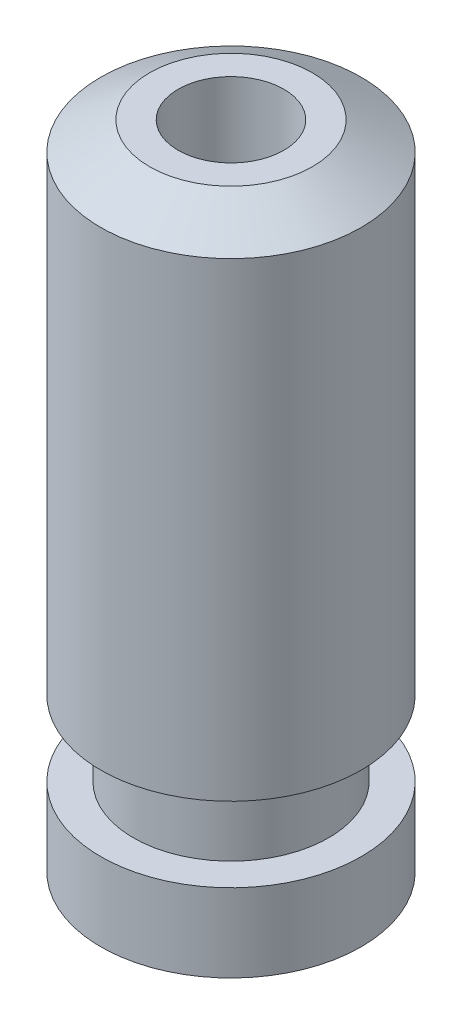
ISO-10303-21;
HEADER;
FILE_DESCRIPTION(('STEP AP214'),'2;1');
FILE_NAME('part.step','',(''),(''),'','','');
FILE_SCHEMA(('AUTOMOTIVE_DESIGN { 1 0 10303 214 1 1 1 1 }'));
ENDSEC;
DATA;
#1=APPLICATION_CONTEXT('core data for automotive mechanical design processes');
#2=APPLICATION_PROTOCOL_DEFINITION('international standard','automotive_design',2000,#1);
#3=PRODUCT_CONTEXT('',#1,'mechanical');
#4=PRODUCT('Part','Part','',(#3));
#5=PRODUCT_RELATED_PRODUCT_CATEGORY('part','',(#4));
#6=PRODUCT_DEFINITION_FORMATION('','',#4);
#7=PRODUCT_DEFINITION_CONTEXT('part definition',#1,'design');
#8=PRODUCT_DEFINITION('design','',#6,#7);
#9=PRODUCT_DEFINITION_SHAPE('','',#8);
#10=(LENGTH_UNIT() NAMED_UNIT(*) SI_UNIT(.MILLI.,.METRE.));
#11=(NAMED_UNIT(*) PLANE_ANGLE_UNIT() SI_UNIT($,.RADIAN.));
#12=(NAMED_UNIT(*) SI_UNIT($,.STERADIAN.) SOLID_ANGLE_UNIT());
#13=UNCERTAINTY_MEASURE_WITH_UNIT(LENGTH_MEASURE(1.E-05),#10,'distance_accuracy_value','');
#14=(GEOMETRIC_REPRESENTATION_CONTEXT(3) GLOBAL_UNCERTAINTY_ASSIGNED_CONTEXT((#13)) GLOBAL_UNIT_ASSIGNED_CONTEXT((#10,
#11,#12)) REPRESENTATION_CONTEXT('',''));
#15=CARTESIAN_POINT('',(0.,0.,0.));
#16=DIRECTION('',(0.,0.,1.));
#17=DIRECTION('',(1.,0.,0.));
#18=AXIS2_PLACEMENT_3D('',#15,#16,#17);
#19=CARTESIAN_POINT('',(0.,0.,0.));
#20=DIRECTION('',(0.,1.,0.));
#21=DIRECTION('',(-1.,0.,0.));
#22=AXIS2_PLACEMENT_3D('',#19,#20,#21);
#23=PLANE('',#22);
#24=CARTESIAN_POINT('',(0.,0.,0.));
#25=DIRECTION('',(0.,-1.,0.));
#26=DIRECTION('',(1.,0.,0.));
#27=AXIS2_PLACEMENT_3D('',#24,#25,#26);
#28=CIRCLE('',#27,3.25);
#29=CARTESIAN_POINT('',(3.25,0.,0.));
#30=VERTEX_POINT('',#29);
#31=EDGE_CURVE('E59',#30,#30,#28,.T.);
#32=ORIENTED_EDGE('',*,*,#31,.F.);
#33=EDGE_LOOP('',(#32));
#34=FACE_BOUND('',#33,.T.);
#35=CARTESIAN_POINT('',(0.,0.,0.));
#36=DIRECTION('',(0.,1.,0.));
#37=DIRECTION('',(-1.,0.,0.));
#38=AXIS2_PLACEMENT_3D('',#35,#36,#37);
#39=CIRCLE('',#38,8.);
#40=CARTESIAN_POINT('',(-8.,0.,0.));
#41=VERTEX_POINT('',#40);
#42=EDGE_CURVE('E10',#41,#41,#39,.T.);
#43=ORIENTED_EDGE('',*,*,#42,.F.);
#44=EDGE_LOOP('',(#43));
#45=FACE_BOUND('',#44,.T.);
#46=ADVANCED_FACE('F30',(#34,#45),#23,.F.);
#47=CARTESIAN_POINT('',(0.,40.,0.));
#48=DIRECTION('',(0.,1.,0.));
#49=DIRECTION('',(-1.,0.,0.));
#50=AXIS2_PLACEMENT_3D('',#47,#48,#49);
#51=CYLINDRICAL_SURFACE('',#50,8.);
#52=CARTESIAN_POINT('',(0.,4.8,0.));
#53=DIRECTION('',(0.,1.,0.));
#54=DIRECTION('',(-1.,0.,0.));
#55=AXIS2_PLACEMENT_3D('',#52,#53,#54);
#56=CIRCLE('',#55,8.);
#57=CARTESIAN_POINT('',(-8.,4.8,0.));
#58=VERTEX_POINT('',#57);
#59=EDGE_CURVE('E36',#58,#58,#56,.T.);
#60=ORIENTED_EDGE('',*,*,#59,.F.);
#61=EDGE_LOOP('',(#60));
#62=FACE_BOUND('',#61,.T.);
#63=ORIENTED_EDGE('',*,*,#42,.T.);
#64=EDGE_LOOP('',(#63));
#65=FACE_BOUND('',#64,.T.);
#66=ADVANCED_FACE('F76',(#62,#65),#51,.T.);
#67=CARTESIAN_POINT('',(8.,4.8,0.));
#68=DIRECTION('',(0.,-1.,0.));
#69=DIRECTION('',(1.,0.,0.));
#70=AXIS2_PLACEMENT_3D('',#67,#68,#69);
#71=PLANE('',#70);
#72=CARTESIAN_POINT('',(0.,4.8,0.));
#73=DIRECTION('',(0.,1.,0.));
#74=DIRECTION('',(-1.,0.,0.));
#75=AXIS2_PLACEMENT_3D('',#72,#73,#74);
#76=CIRCLE('',#75,6.00000000000001);
#77=CARTESIAN_POINT('',(-6.00000000000001,4.8,0.));
#78=VERTEX_POINT('',#77);
#79=EDGE_CURVE('E40',#78,#78,#76,.T.);
#80=ORIENTED_EDGE('',*,*,#79,.F.);
#81=EDGE_LOOP('',(#80));
#82=FACE_BOUND('',#81,.T.);
#83=ORIENTED_EDGE('',*,*,#59,.T.);
#84=EDGE_LOOP('',(#83));
#85=FACE_BOUND('',#84,.T.);
#86=ADVANCED_FACE('F80',(#82,#85),#71,.F.);
#87=CARTESIAN_POINT('',(0.,40.,0.));
#88=DIRECTION('',(0.,1.,0.));
#89=DIRECTION('',(-1.,0.,0.));
#90=AXIS2_PLACEMENT_3D('',#87,#88,#89);
#91=CYLINDRICAL_SURFACE('',#90,6.00000000000001);
#92=CARTESIAN_POINT('',(0.,9.4,0.));
#93=DIRECTION('',(0.,1.,0.));
#94=DIRECTION('',(-1.,0.,0.));
#95=AXIS2_PLACEMENT_3D('',#92,#93,#94);
#96=CIRCLE('',#95,6.00000000000001);
#97=CARTESIAN_POINT('',(-6.00000000000001,9.4,0.));
#98=VERTEX_POINT('',#97);
#99=EDGE_CURVE('E44',#98,#98,#96,.T.);
#100=ORIENTED_EDGE('',*,*,#99,.F.);
#101=EDGE_LOOP('',(#100));
#102=FACE_BOUND('',#101,.T.);
#103=ORIENTED_EDGE('',*,*,#79,.T.);
#104=EDGE_LOOP('',(#103));
#105=FACE_BOUND('',#104,.T.);
#106=ADVANCED_FACE('F85',(#102,#105),#91,.T.);
#107=CARTESIAN_POINT('',(6.00000000000001,9.4,0.));
#108=DIRECTION('',(0.,1.,0.));
#109=DIRECTION('',(-1.,0.,0.));
#110=AXIS2_PLACEMENT_3D('',#107,#108,#109);
#111=PLANE('',#110);
#112=CARTESIAN_POINT('',(0.,9.4,0.));
#113=DIRECTION('',(0.,1.,0.));
#114=DIRECTION('',(-1.,0.,0.));
#115=AXIS2_PLACEMENT_3D('',#112,#113,#114);
#116=CIRCLE('',#115,8.00000000000001);
#117=CARTESIAN_POINT('',(-8.00000000000001,9.4,0.));
#118=VERTEX_POINT('',#117);
#119=EDGE_CURVE('E49',#118,#118,#116,.T.);
#120=ORIENTED_EDGE('',*,*,#119,.F.);
#121=EDGE_LOOP('',(#120));
#122=FACE_BOUND('',#121,.T.);
#123=ORIENTED_EDGE('',*,*,#99,.T.);
#124=EDGE_LOOP('',(#123));
#125=FACE_BOUND('',#124,.T.);
#126=ADVANCED_FACE('F91',(#122,#125),#111,.F.);
#127=CARTESIAN_POINT('',(0.,40.,0.));
#128=DIRECTION('',(0.,1.,0.));
#129=DIRECTION('',(-1.,0.,0.));
#130=AXIS2_PLACEMENT_3D('',#127,#128,#129);
#131=CYLINDRICAL_SURFACE('',#130,8.);
#132=CARTESIAN_POINT('',(0.,38.2679491924311,0.));
#133=DIRECTION('',(0.,1.,0.));
#134=DIRECTION('',(-1.,0.,0.));
#135=AXIS2_PLACEMENT_3D('',#132,#133,#134);
#136=CIRCLE('',#135,7.99999999999999);
#137=CARTESIAN_POINT('',(-7.99999999999999,38.2679491924311,0.));
#138=VERTEX_POINT('',#137);
#139=EDGE_CURVE('E52',#138,#138,#136,.T.);
#140=ORIENTED_EDGE('',*,*,#139,.F.);
#141=EDGE_LOOP('',(#140));
#142=FACE_BOUND('',#141,.T.);
#143=ORIENTED_EDGE('',*,*,#119,.T.);
#144=EDGE_LOOP('',(#143));
#145=FACE_BOUND('',#144,.T.);
#146=ADVANCED_FACE('F95',(#142,#145),#131,.T.);
#147=CARTESIAN_POINT('',(0.,38.2679491924311,0.));
#148=DIRECTION('',(0.,-1.,0.));
#149=DIRECTION('',(1.,0.,0.));
#150=AXIS2_PLACEMENT_3D('',#147,#148,#149);
#151=CONICAL_SURFACE('',#150,7.99999999999999,1.0471975511966);
#152=CARTESIAN_POINT('',(0.,40.,0.));
#153=DIRECTION('',(0.,1.,0.));
#154=DIRECTION('',(-1.,0.,0.));
#155=AXIS2_PLACEMENT_3D('',#152,#153,#154);
#156=CIRCLE('',#155,5.);
#157=CARTESIAN_POINT('',(-4.99999999999999,40.,0.));
#158=VERTEX_POINT('',#157);
#159=EDGE_CURVE('E55',#158,#158,#156,.T.);
#160=ORIENTED_EDGE('',*,*,#159,.F.);
#161=EDGE_LOOP('',(#160));
#162=FACE_BOUND('',#161,.T.);
#163=ORIENTED_EDGE('',*,*,#139,.T.);
#164=EDGE_LOOP('',(#163));
#165=FACE_BOUND('',#164,.T.);
#166=ADVANCED_FACE('F99',(#162,#165),#151,.T.);
#167=CARTESIAN_POINT('',(0.,40.,0.));
#168=DIRECTION('',(0.,-1.,0.));
#169=DIRECTION('',(1.,0.,0.));
#170=AXIS2_PLACEMENT_3D('',#167,#168,#169);
#171=PLANE('',#170);
#172=CARTESIAN_POINT('',(0.,40.,0.));
#173=DIRECTION('',(0.,-1.,0.));
#174=DIRECTION('',(1.,0.,0.));
#175=AXIS2_PLACEMENT_3D('',#172,#173,#174);
#176=CIRCLE('',#175,3.25);
#177=CARTESIAN_POINT('',(3.25,40.,0.));
#178=VERTEX_POINT('',#177);
#179=EDGE_CURVE('E58',#178,#178,#176,.T.);
#180=ORIENTED_EDGE('',*,*,#179,.T.);
#181=EDGE_LOOP('',(#180));
#182=FACE_BOUND('',#181,.T.);
#183=ORIENTED_EDGE('',*,*,#159,.T.);
#184=EDGE_LOOP('',(#183));
#185=FACE_BOUND('',#184,.T.);
#186=ADVANCED_FACE('F65',(#182,#185),#171,.F.);
#187=CARTESIAN_POINT('',(0.,40.,0.));
#188=DIRECTION('',(0.,-1.,0.));
#189=DIRECTION('',(1.,0.,0.));
#190=AXIS2_PLACEMENT_3D('',#187,#188,#189);
#191=CYLINDRICAL_SURFACE('',#190,3.25);
#192=ORIENTED_EDGE('',*,*,#179,.F.);
#193=EDGE_LOOP('',(#192));
#194=FACE_BOUND('',#193,.T.);
#195=ORIENTED_EDGE('',*,*,#31,.T.);
#196=EDGE_LOOP('',(#195));
#197=FACE_BOUND('',#196,.T.);
#198=ADVANCED_FACE('F68',(#194,#197),#191,.F.);
#199=CLOSED_SHELL('',(#46,#66,#86,#106,#126,#146,#166,#186,#198));
#200=MANIFOLD_SOLID_BREP('B2',#199);
#201=ADVANCED_BREP_SHAPE_REPRESENTATION('',(#18,#200),#14);
#202=SHAPE_DEFINITION_REPRESENTATION(#9,#201);
ENDSEC;
END-ISO-10303-21;
